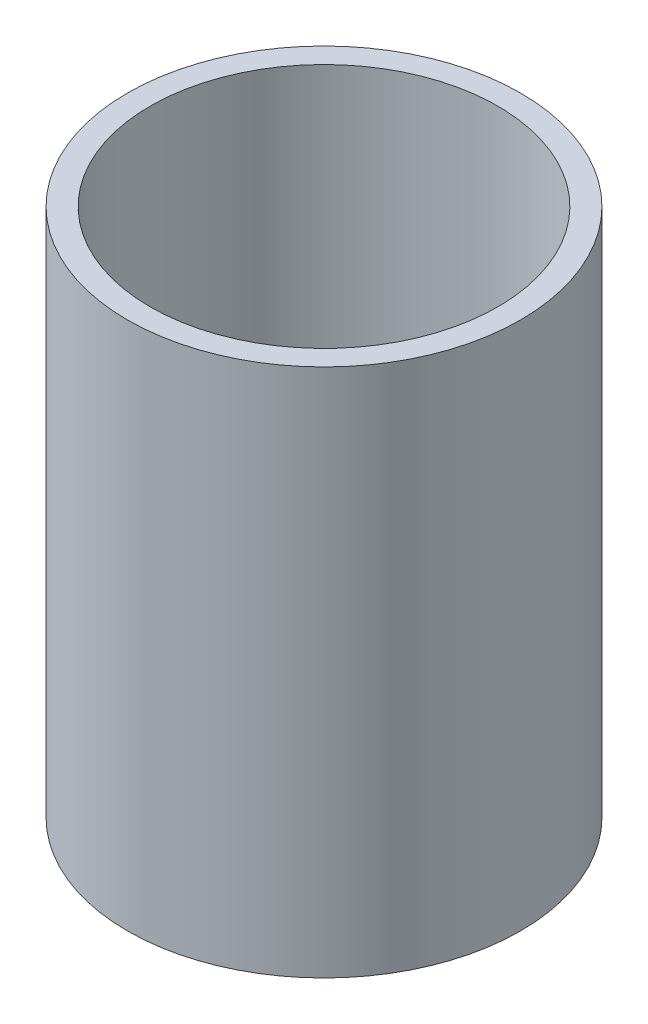
ISO-10303-21;
HEADER;
FILE_DESCRIPTION(('STEP AP214'),'2;1');
FILE_NAME('part.step','',(''),(''),'','','');
FILE_SCHEMA(('AUTOMOTIVE_DESIGN { 1 0 10303 214 1 1 1 1 }'));
ENDSEC;
DATA;
#1=APPLICATION_CONTEXT('core data for automotive mechanical design processes');
#2=APPLICATION_PROTOCOL_DEFINITION('international standard','automotive_design',2000,#1);
#3=PRODUCT_CONTEXT('',#1,'mechanical');
#4=PRODUCT('Part','Part','',(#3));
#5=PRODUCT_RELATED_PRODUCT_CATEGORY('part','',(#4));
#6=PRODUCT_DEFINITION_FORMATION('','',#4);
#7=PRODUCT_DEFINITION_CONTEXT('part definition',#1,'design');
#8=PRODUCT_DEFINITION('design','',#6,#7);
#9=PRODUCT_DEFINITION_SHAPE('','',#8);
#10=(LENGTH_UNIT() NAMED_UNIT(*) SI_UNIT(.MILLI.,.METRE.));
#11=(NAMED_UNIT(*) PLANE_ANGLE_UNIT() SI_UNIT($,.RADIAN.));
#12=(NAMED_UNIT(*) SI_UNIT($,.STERADIAN.) SOLID_ANGLE_UNIT());
#13=UNCERTAINTY_MEASURE_WITH_UNIT(LENGTH_MEASURE(1.E-05),#10,'distance_accuracy_value','');
#14=(GEOMETRIC_REPRESENTATION_CONTEXT(3) GLOBAL_UNCERTAINTY_ASSIGNED_CONTEXT((#13)) GLOBAL_UNIT_ASSIGNED_CONTEXT((#10,
#11,#12)) REPRESENTATION_CONTEXT('',''));
#15=CARTESIAN_POINT('',(0.,0.,0.));
#16=DIRECTION('',(0.,0.,1.));
#17=DIRECTION('',(1.,0.,0.));
#18=AXIS2_PLACEMENT_3D('',#15,#16,#17);
#19=CARTESIAN_POINT('',(0.,35.,0.));
#20=DIRECTION('',(0.,1.,0.));
#21=DIRECTION('',(0.,0.,1.));
#22=AXIS2_PLACEMENT_3D('',#19,#20,#21);
#23=PLANE('',#22);
#24=CARTESIAN_POINT('',(0.,35.,0.));
#25=DIRECTION('',(0.,1.,0.));
#26=DIRECTION('',(0.,0.,1.));
#27=AXIS2_PLACEMENT_3D('',#24,#25,#26);
#28=CIRCLE('',#27,26.);
#29=CARTESIAN_POINT('',(0.,35.,26.));
#30=VERTEX_POINT('',#29);
#31=EDGE_CURVE('E10',#30,#30,#28,.T.);
#32=ORIENTED_EDGE('',*,*,#31,.T.);
#33=EDGE_LOOP('',(#32));
#34=FACE_BOUND('',#33,.T.);
#35=CARTESIAN_POINT('',(0.,35.,0.));
#36=DIRECTION('',(0.,1.,0.));
#37=DIRECTION('',(0.,0.,1.));
#38=AXIS2_PLACEMENT_3D('',#35,#36,#37);
#39=CIRCLE('',#38,23.);
#40=CARTESIAN_POINT('',(0.,35.,23.));
#41=VERTEX_POINT('',#40);
#42=EDGE_CURVE('E42',#41,#41,#39,.T.);
#43=ORIENTED_EDGE('',*,*,#42,.F.);
#44=EDGE_LOOP('',(#43));
#45=FACE_BOUND('',#44,.T.);
#46=ADVANCED_FACE('F31',(#34,#45),#23,.T.);
#47=CARTESIAN_POINT('',(0.,-35.,0.));
#48=DIRECTION('',(0.,1.,0.));
#49=DIRECTION('',(0.,0.,1.));
#50=AXIS2_PLACEMENT_3D('',#47,#48,#49);
#51=PLANE('',#50);
#52=CARTESIAN_POINT('',(0.,-35.,0.));
#53=DIRECTION('',(0.,1.,0.));
#54=DIRECTION('',(0.,0.,1.));
#55=AXIS2_PLACEMENT_3D('',#52,#53,#54);
#56=CIRCLE('',#55,26.);
#57=CARTESIAN_POINT('',(0.,-35.,26.));
#58=VERTEX_POINT('',#57);
#59=EDGE_CURVE('E35',#58,#58,#56,.T.);
#60=ORIENTED_EDGE('',*,*,#59,.F.);
#61=EDGE_LOOP('',(#60));
#62=FACE_BOUND('',#61,.T.);
#63=CARTESIAN_POINT('',(0.,-35.,0.));
#64=DIRECTION('',(0.,1.,0.));
#65=DIRECTION('',(0.,0.,1.));
#66=AXIS2_PLACEMENT_3D('',#63,#64,#65);
#67=CIRCLE('',#66,23.);
#68=CARTESIAN_POINT('',(0.,-35.,23.));
#69=VERTEX_POINT('',#68);
#70=EDGE_CURVE('E44',#69,#69,#67,.T.);
#71=ORIENTED_EDGE('',*,*,#70,.T.);
#72=EDGE_LOOP('',(#71));
#73=FACE_BOUND('',#72,.T.);
#74=ADVANCED_FACE('F54',(#62,#73),#51,.F.);
#75=CARTESIAN_POINT('',(0.,35.,0.));
#76=DIRECTION('',(0.,-1.,0.));
#77=DIRECTION('',(0.,0.,-1.));
#78=AXIS2_PLACEMENT_3D('',#75,#76,#77);
#79=CYLINDRICAL_SURFACE('',#78,26.);
#80=ORIENTED_EDGE('',*,*,#31,.F.);
#81=EDGE_LOOP('',(#80));
#82=FACE_BOUND('',#81,.T.);
#83=ORIENTED_EDGE('',*,*,#59,.T.);
#84=EDGE_LOOP('',(#83));
#85=FACE_BOUND('',#84,.T.);
#86=ADVANCED_FACE('F33',(#82,#85),#79,.T.);
#87=CARTESIAN_POINT('',(0.,35.,0.));
#88=DIRECTION('',(0.,-1.,0.));
#89=DIRECTION('',(0.,0.,-1.));
#90=AXIS2_PLACEMENT_3D('',#87,#88,#89);
#91=CYLINDRICAL_SURFACE('',#90,23.);
#92=ORIENTED_EDGE('',*,*,#42,.T.);
#93=EDGE_LOOP('',(#92));
#94=FACE_BOUND('',#93,.T.);
#95=ORIENTED_EDGE('',*,*,#70,.F.);
#96=EDGE_LOOP('',(#95));
#97=FACE_BOUND('',#96,.T.);
#98=ADVANCED_FACE('F50',(#94,#97),#91,.F.);
#99=CLOSED_SHELL('',(#46,#74,#86,#98));
#100=MANIFOLD_SOLID_BREP('B2',#99);
#101=ADVANCED_BREP_SHAPE_REPRESENTATION('',(#18,#100),#14);
#102=SHAPE_DEFINITION_REPRESENTATION(#9,#101);
ENDSEC;
END-ISO-10303-21;
